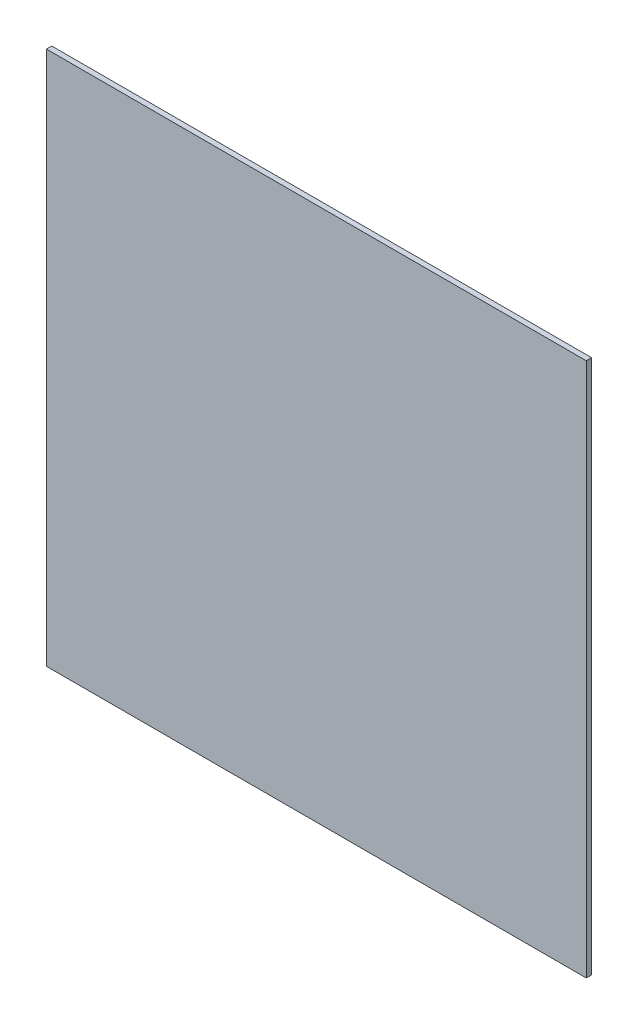
ISO-10303-21;
HEADER;
FILE_DESCRIPTION(('STEP AP214'),'2;1');
FILE_NAME('part.step','',(''),(''),'','','');
FILE_SCHEMA(('AUTOMOTIVE_DESIGN { 1 0 10303 214 1 1 1 1 }'));
ENDSEC;
DATA;
#1=APPLICATION_CONTEXT('core data for automotive mechanical design processes');
#2=APPLICATION_PROTOCOL_DEFINITION('international standard','automotive_design',2000,#1);
#3=PRODUCT_CONTEXT('',#1,'mechanical');
#4=PRODUCT('Part','Part','',(#3));
#5=PRODUCT_RELATED_PRODUCT_CATEGORY('part','',(#4));
#6=PRODUCT_DEFINITION_FORMATION('','',#4);
#7=PRODUCT_DEFINITION_CONTEXT('part definition',#1,'design');
#8=PRODUCT_DEFINITION('design','',#6,#7);
#9=PRODUCT_DEFINITION_SHAPE('','',#8);
#10=(LENGTH_UNIT() NAMED_UNIT(*) SI_UNIT(.MILLI.,.METRE.));
#11=(NAMED_UNIT(*) PLANE_ANGLE_UNIT() SI_UNIT($,.RADIAN.));
#12=(NAMED_UNIT(*) SI_UNIT($,.STERADIAN.) SOLID_ANGLE_UNIT());
#13=UNCERTAINTY_MEASURE_WITH_UNIT(LENGTH_MEASURE(1.E-05),#10,'distance_accuracy_value','');
#14=(GEOMETRIC_REPRESENTATION_CONTEXT(3) GLOBAL_UNCERTAINTY_ASSIGNED_CONTEXT((#13)) GLOBAL_UNIT_ASSIGNED_CONTEXT((#10,
#11,#12)) REPRESENTATION_CONTEXT('',''));
#15=CARTESIAN_POINT('',(0.,0.,0.));
#16=DIRECTION('',(0.,0.,1.));
#17=DIRECTION('',(1.,0.,0.));
#18=AXIS2_PLACEMENT_3D('',#15,#16,#17);
#19=CARTESIAN_POINT('',(0.,0.,3.));
#20=DIRECTION('',(1.,0.,0.));
#21=DIRECTION('',(0.,0.,-1.));
#22=AXIS2_PLACEMENT_3D('',#19,#20,#21);
#23=PLANE('',#22);
#24=DIRECTION('',(0.,-1.,0.));
#25=VECTOR('',#24,1.);
#26=CARTESIAN_POINT('',(0.,0.,0.));
#27=LINE('',#26,#25);
#28=CARTESIAN_POINT('',(0.,302.,0.));
#29=VERTEX_POINT('',#28);
#30=CARTESIAN_POINT('',(0.,0.,0.));
#31=VERTEX_POINT('',#30);
#32=EDGE_CURVE('E97',#29,#31,#27,.T.);
#33=ORIENTED_EDGE('',*,*,#32,.T.);
#34=DIRECTION('',(0.,0.,-1.));
#35=VECTOR('',#34,1.);
#36=CARTESIAN_POINT('',(0.,0.,3.));
#37=LINE('',#36,#35);
#38=CARTESIAN_POINT('',(0.,0.,3.));
#39=VERTEX_POINT('',#38);
#40=EDGE_CURVE('E11',#39,#31,#37,.T.);
#41=ORIENTED_EDGE('',*,*,#40,.F.);
#42=DIRECTION('',(0.,-1.,0.));
#43=VECTOR('',#42,1.);
#44=CARTESIAN_POINT('',(0.,0.,3.));
#45=LINE('',#44,#43);
#46=CARTESIAN_POINT('',(0.,302.,3.));
#47=VERTEX_POINT('',#46);
#48=EDGE_CURVE('E85',#47,#39,#45,.T.);
#49=ORIENTED_EDGE('',*,*,#48,.F.);
#50=DIRECTION('',(0.,0.,-1.));
#51=VECTOR('',#50,1.);
#52=CARTESIAN_POINT('',(0.,302.,3.));
#53=LINE('',#52,#51);
#54=EDGE_CURVE('E93',#47,#29,#53,.T.);
#55=ORIENTED_EDGE('',*,*,#54,.T.);
#56=EDGE_LOOP('',(#33,#41,#49,#55));
#57=FACE_BOUND('',#56,.T.);
#58=ADVANCED_FACE('F34',(#57),#23,.F.);
#59=CARTESIAN_POINT('',(0.,0.,3.));
#60=DIRECTION('',(0.,1.,0.));
#61=DIRECTION('',(0.,0.,1.));
#62=AXIS2_PLACEMENT_3D('',#59,#60,#61);
#63=PLANE('',#62);
#64=DIRECTION('',(1.,0.,0.));
#65=VECTOR('',#64,1.);
#66=CARTESIAN_POINT('',(0.,0.,0.));
#67=LINE('',#66,#65);
#68=CARTESIAN_POINT('',(305.,0.,0.));
#69=VERTEX_POINT('',#68);
#70=EDGE_CURVE('E89',#31,#69,#67,.T.);
#71=ORIENTED_EDGE('',*,*,#70,.T.);
#72=DIRECTION('',(0.,0.,-1.));
#73=VECTOR('',#72,1.);
#74=CARTESIAN_POINT('',(305.,0.,3.));
#75=LINE('',#74,#73);
#76=CARTESIAN_POINT('',(305.,0.,3.));
#77=VERTEX_POINT('',#76);
#78=EDGE_CURVE('E42',#77,#69,#75,.T.);
#79=ORIENTED_EDGE('',*,*,#78,.F.);
#80=DIRECTION('',(1.,0.,0.));
#81=VECTOR('',#80,1.);
#82=CARTESIAN_POINT('',(0.,0.,3.));
#83=LINE('',#82,#81);
#84=EDGE_CURVE('E80',#39,#77,#83,.T.);
#85=ORIENTED_EDGE('',*,*,#84,.F.);
#86=ORIENTED_EDGE('',*,*,#40,.T.);
#87=EDGE_LOOP('',(#71,#79,#85,#86));
#88=FACE_BOUND('',#87,.T.);
#89=ADVANCED_FACE('F88',(#88),#63,.F.);
#90=CARTESIAN_POINT('',(305.,0.,3.));
#91=DIRECTION('',(-1.,0.,0.));
#92=DIRECTION('',(0.,0.,1.));
#93=AXIS2_PLACEMENT_3D('',#90,#91,#92);
#94=PLANE('',#93);
#95=DIRECTION('',(0.,1.,0.));
#96=VECTOR('',#95,1.);
#97=CARTESIAN_POINT('',(305.,0.,0.));
#98=LINE('',#97,#96);
#99=CARTESIAN_POINT('',(305.,302.,0.));
#100=VERTEX_POINT('',#99);
#101=EDGE_CURVE('E67',#69,#100,#98,.T.);
#102=ORIENTED_EDGE('',*,*,#101,.T.);
#103=DIRECTION('',(0.,0.,-1.));
#104=VECTOR('',#103,1.);
#105=CARTESIAN_POINT('',(305.,302.,3.));
#106=LINE('',#105,#104);
#107=CARTESIAN_POINT('',(305.,302.,3.));
#108=VERTEX_POINT('',#107);
#109=EDGE_CURVE('E90',#108,#100,#106,.T.);
#110=ORIENTED_EDGE('',*,*,#109,.F.);
#111=DIRECTION('',(0.,1.,0.));
#112=VECTOR('',#111,1.);
#113=CARTESIAN_POINT('',(305.,0.,3.));
#114=LINE('',#113,#112);
#115=EDGE_CURVE('E83',#77,#108,#114,.T.);
#116=ORIENTED_EDGE('',*,*,#115,.F.);
#117=ORIENTED_EDGE('',*,*,#78,.T.);
#118=EDGE_LOOP('',(#102,#110,#116,#117));
#119=FACE_BOUND('',#118,.T.);
#120=ADVANCED_FACE('F91',(#119),#94,.F.);
#121=CARTESIAN_POINT('',(0.,302.,3.));
#122=DIRECTION('',(0.,-1.,0.));
#123=DIRECTION('',(0.,0.,-1.));
#124=AXIS2_PLACEMENT_3D('',#121,#122,#123);
#125=PLANE('',#124);
#126=DIRECTION('',(-1.,0.,0.));
#127=VECTOR('',#126,1.);
#128=CARTESIAN_POINT('',(0.,302.,0.));
#129=LINE('',#128,#127);
#130=EDGE_CURVE('E73',#100,#29,#129,.T.);
#131=ORIENTED_EDGE('',*,*,#130,.T.);
#132=ORIENTED_EDGE('',*,*,#54,.F.);
#133=DIRECTION('',(-1.,0.,0.));
#134=VECTOR('',#133,1.);
#135=CARTESIAN_POINT('',(0.,302.,3.));
#136=LINE('',#135,#134);
#137=EDGE_CURVE('E50',#108,#47,#136,.T.);
#138=ORIENTED_EDGE('',*,*,#137,.F.);
#139=ORIENTED_EDGE('',*,*,#109,.T.);
#140=EDGE_LOOP('',(#131,#132,#138,#139));
#141=FACE_BOUND('',#140,.T.);
#142=ADVANCED_FACE('F104',(#141),#125,.F.);
#143=CARTESIAN_POINT('',(0.,0.,3.));
#144=DIRECTION('',(0.,0.,-1.));
#145=DIRECTION('',(-1.,0.,0.));
#146=AXIS2_PLACEMENT_3D('',#143,#144,#145);
#147=PLANE('',#146);
#148=ORIENTED_EDGE('',*,*,#48,.T.);
#149=ORIENTED_EDGE('',*,*,#84,.T.);
#150=ORIENTED_EDGE('',*,*,#115,.T.);
#151=ORIENTED_EDGE('',*,*,#137,.T.);
#152=EDGE_LOOP('',(#148,#149,#150,#151));
#153=FACE_BOUND('',#152,.T.);
#154=ADVANCED_FACE('F81',(#153),#147,.F.);
#155=CARTESIAN_POINT('',(0.,0.,0.));
#156=DIRECTION('',(0.,0.,-1.));
#157=DIRECTION('',(-1.,0.,0.));
#158=AXIS2_PLACEMENT_3D('',#155,#156,#157);
#159=PLANE('',#158);
#160=ORIENTED_EDGE('',*,*,#32,.F.);
#161=ORIENTED_EDGE('',*,*,#130,.F.);
#162=ORIENTED_EDGE('',*,*,#101,.F.);
#163=ORIENTED_EDGE('',*,*,#70,.F.);
#164=EDGE_LOOP('',(#160,#161,#162,#163));
#165=FACE_BOUND('',#164,.T.);
#166=ADVANCED_FACE('F107',(#165),#159,.T.);
#167=CLOSED_SHELL('',(#58,#89,#120,#142,#154,#166));
#168=MANIFOLD_SOLID_BREP('B2',#167);
#169=ADVANCED_BREP_SHAPE_REPRESENTATION('',(#18,#168),#14);
#170=SHAPE_DEFINITION_REPRESENTATION(#9,#169);
ENDSEC;
END-ISO-10303-21;
